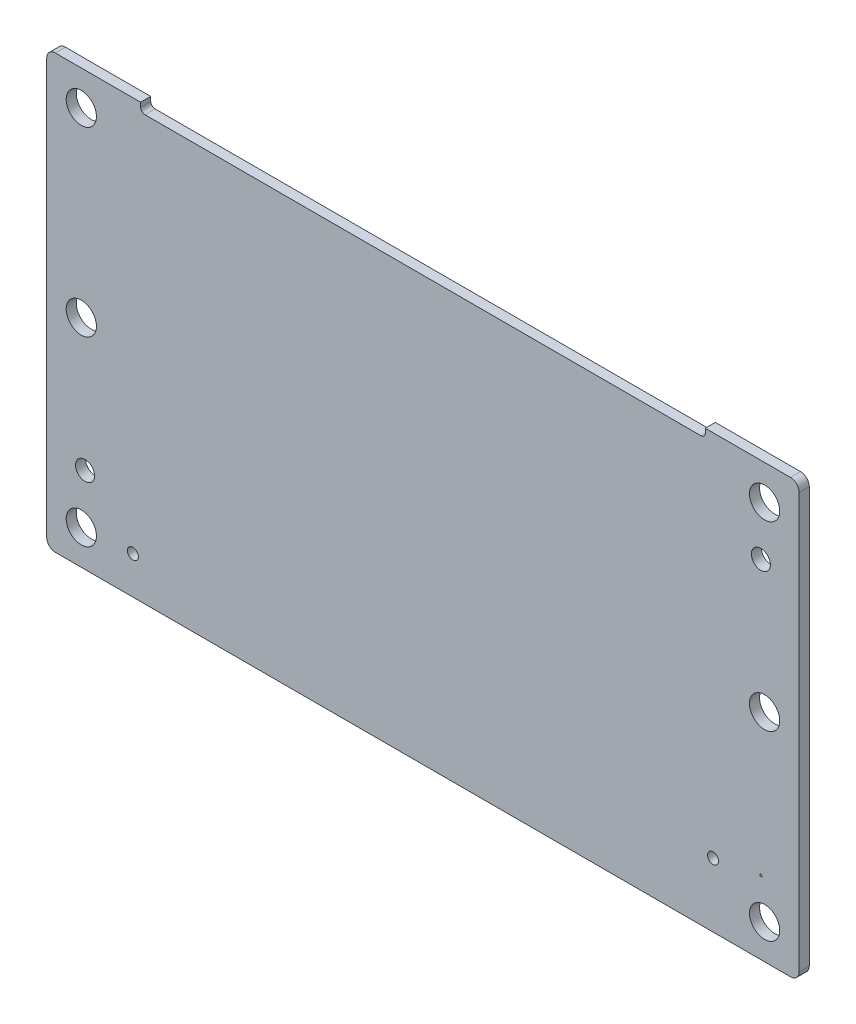
ISO-10303-21;
HEADER;
FILE_DESCRIPTION(('STEP AP214'),'2;1');
FILE_NAME('part.step','',(''),(''),'','','');
FILE_SCHEMA(('AUTOMOTIVE_DESIGN { 1 0 10303 214 1 1 1 1 }'));
ENDSEC;
DATA;
#1=APPLICATION_CONTEXT('core data for automotive mechanical design processes');
#2=APPLICATION_PROTOCOL_DEFINITION('international standard','automotive_design',2000,#1);
#3=PRODUCT_CONTEXT('',#1,'mechanical');
#4=PRODUCT('Part','Part','',(#3));
#5=PRODUCT_RELATED_PRODUCT_CATEGORY('part','',(#4));
#6=PRODUCT_DEFINITION_FORMATION('','',#4);
#7=PRODUCT_DEFINITION_CONTEXT('part definition',#1,'design');
#8=PRODUCT_DEFINITION('design','',#6,#7);
#9=PRODUCT_DEFINITION_SHAPE('','',#8);
#10=(LENGTH_UNIT() NAMED_UNIT(*) SI_UNIT(.MILLI.,.METRE.));
#11=(NAMED_UNIT(*) PLANE_ANGLE_UNIT() SI_UNIT($,.RADIAN.));
#12=(NAMED_UNIT(*) SI_UNIT($,.STERADIAN.) SOLID_ANGLE_UNIT());
#13=UNCERTAINTY_MEASURE_WITH_UNIT(LENGTH_MEASURE(1.E-05),#10,'distance_accuracy_value','');
#14=(GEOMETRIC_REPRESENTATION_CONTEXT(3) GLOBAL_UNCERTAINTY_ASSIGNED_CONTEXT((#13)) GLOBAL_UNIT_ASSIGNED_CONTEXT((#10,
#11,#12)) REPRESENTATION_CONTEXT('',''));
#15=CARTESIAN_POINT('',(0.,0.,0.));
#16=DIRECTION('',(0.,0.,1.));
#17=DIRECTION('',(1.,0.,0.));
#18=AXIS2_PLACEMENT_3D('',#15,#16,#17);
#19=CARTESIAN_POINT('',(0.,0.,1.16399999999992));
#20=DIRECTION('',(0.,0.,1.));
#21=DIRECTION('',(1.,0.,0.));
#22=AXIS2_PLACEMENT_3D('',#19,#20,#21);
#23=PLANE('',#22);
#24=CARTESIAN_POINT('',(0.4319999996,5.9180000004,1.16399999999992));
#25=DIRECTION('',(0.,0.,1.));
#26=DIRECTION('',(1.,0.,0.));
#27=AXIS2_PLACEMENT_3D('',#24,#25,#26);
#28=CIRCLE('',#27,1.0999999971);
#29=CARTESIAN_POINT('',(1.5319999967,5.9180000004,1.16399999999992));
#30=VERTEX_POINT('',#29);
#31=EDGE_CURVE('E220',#30,#30,#28,.F.);
#32=ORIENTED_EDGE('',*,*,#31,.T.);
#33=EDGE_LOOP('',(#32));
#34=FACE_BOUND('',#33,.T.);
#35=CARTESIAN_POINT('',(78.5700000098,4.4300000046,1.16399999999992));
#36=DIRECTION('',(0.,0.,1.));
#37=DIRECTION('',(1.,0.,0.));
#38=AXIS2_PLACEMENT_3D('',#35,#36,#37);
#39=CIRCLE('',#38,0.125000004);
#40=CARTESIAN_POINT('',(78.6950000138,4.4300000046,1.16399999999992));
#41=VERTEX_POINT('',#40);
#42=EDGE_CURVE('E223',#41,#41,#39,.F.);
#43=ORIENTED_EDGE('',*,*,#42,.T.);
#44=EDGE_LOOP('',(#43));
#45=FACE_BOUND('',#44,.T.);
#46=CARTESIAN_POINT('',(78.5700000098,36.0800000014,1.16399999999992));
#47=DIRECTION('',(0.,0.,1.));
#48=DIRECTION('',(1.,0.,0.));
#49=AXIS2_PLACEMENT_3D('',#46,#47,#48);
#50=CIRCLE('',#49,1.0999999971);
#51=CARTESIAN_POINT('',(79.6700000069,36.0800000014,1.16399999999992));
#52=VERTEX_POINT('',#51);
#53=EDGE_CURVE('E226',#52,#52,#50,.F.);
#54=ORIENTED_EDGE('',*,*,#53,.T.);
#55=EDGE_LOOP('',(#54));
#56=FACE_BOUND('',#55,.T.);
#57=CARTESIAN_POINT('',(78.999999988,41.9999999978,1.16399999999992));
#58=DIRECTION('',(0.,0.,1.));
#59=DIRECTION('',(1.,0.,0.));
#60=AXIS2_PLACEMENT_3D('',#57,#58,#59);
#61=CIRCLE('',#60,1.7500000052);
#62=CARTESIAN_POINT('',(80.7499999932,41.9999999978,1.16399999999992));
#63=VERTEX_POINT('',#62);
#64=EDGE_CURVE('E229',#63,#63,#61,.F.);
#65=ORIENTED_EDGE('',*,*,#64,.T.);
#66=EDGE_LOOP('',(#65));
#67=FACE_BOUND('',#66,.T.);
#68=CARTESIAN_POINT('',(78.999999988,21.0000000116,1.16399999999992));
#69=DIRECTION('',(0.,0.,1.));
#70=DIRECTION('',(1.,0.,0.));
#71=AXIS2_PLACEMENT_3D('',#68,#69,#70);
#72=CIRCLE('',#71,1.7500000052);
#73=CARTESIAN_POINT('',(80.7499999932,21.0000000116,1.16399999999992));
#74=VERTEX_POINT('',#73);
#75=EDGE_CURVE('E232',#74,#74,#72,.F.);
#76=ORIENTED_EDGE('',*,*,#75,.T.);
#77=EDGE_LOOP('',(#76));
#78=FACE_BOUND('',#77,.T.);
#79=CARTESIAN_POINT('',(78.999999988,0.,1.16399999999992));
#80=DIRECTION('',(0.,0.,1.));
#81=DIRECTION('',(1.,0.,0.));
#82=AXIS2_PLACEMENT_3D('',#79,#80,#81);
#83=CIRCLE('',#82,1.7500000052);
#84=CARTESIAN_POINT('',(80.7499999932,0.,1.16399999999992));
#85=VERTEX_POINT('',#84);
#86=EDGE_CURVE('E235',#85,#85,#83,.F.);
#87=ORIENTED_EDGE('',*,*,#86,.T.);
#88=EDGE_LOOP('',(#87));
#89=FACE_BOUND('',#88,.T.);
#90=CARTESIAN_POINT('',(0.,41.9999999978,1.16399999999992));
#91=DIRECTION('',(0.,0.,1.));
#92=DIRECTION('',(1.,0.,0.));
#93=AXIS2_PLACEMENT_3D('',#90,#91,#92);
#94=CIRCLE('',#93,1.7500000052);
#95=CARTESIAN_POINT('',(1.7500000052,41.9999999978,1.16399999999992));
#96=VERTEX_POINT('',#95);
#97=EDGE_CURVE('E238',#96,#96,#94,.F.);
#98=ORIENTED_EDGE('',*,*,#97,.T.);
#99=EDGE_LOOP('',(#98));
#100=FACE_BOUND('',#99,.T.);
#101=CARTESIAN_POINT('',(0.,21.0000000116,1.16399999999992));
#102=DIRECTION('',(0.,0.,1.));
#103=DIRECTION('',(1.,0.,0.));
#104=AXIS2_PLACEMENT_3D('',#101,#102,#103);
#105=CIRCLE('',#104,1.7500000052);
#106=CARTESIAN_POINT('',(1.7500000052,21.0000000116,1.16399999999992));
#107=VERTEX_POINT('',#106);
#108=EDGE_CURVE('E241',#107,#107,#105,.F.);
#109=ORIENTED_EDGE('',*,*,#108,.T.);
#110=EDGE_LOOP('',(#109));
#111=FACE_BOUND('',#110,.T.);
#112=CARTESIAN_POINT('',(0.,0.,1.16399999999992));
#113=DIRECTION('',(0.,0.,1.));
#114=DIRECTION('',(1.,0.,0.));
#115=AXIS2_PLACEMENT_3D('',#112,#113,#114);
#116=CIRCLE('',#115,1.7500000052);
#117=CARTESIAN_POINT('',(1.7500000052,0.,1.16399999999992));
#118=VERTEX_POINT('',#117);
#119=EDGE_CURVE('E244',#118,#118,#116,.F.);
#120=ORIENTED_EDGE('',*,*,#119,.T.);
#121=EDGE_LOOP('',(#120));
#122=FACE_BOUND('',#121,.T.);
#123=CARTESIAN_POINT('',(5.9599999926,0.3500000112,1.16399999999992));
#124=DIRECTION('',(0.,0.,1.));
#125=DIRECTION('',(1.,0.,0.));
#126=AXIS2_PLACEMENT_3D('',#123,#124,#125);
#127=CIRCLE('',#126,0.635);
#128=CARTESIAN_POINT('',(6.5949999926,0.3500000112,1.16399999999992));
#129=VERTEX_POINT('',#128);
#130=EDGE_CURVE('E247',#129,#129,#127,.F.);
#131=ORIENTED_EDGE('',*,*,#130,.T.);
#132=EDGE_LOOP('',(#131));
#133=FACE_BOUND('',#132,.T.);
#134=CARTESIAN_POINT('',(73.0399999954,3.4000000072,1.16399999999992));
#135=DIRECTION('',(0.,0.,1.));
#136=DIRECTION('',(1.,0.,0.));
#137=AXIS2_PLACEMENT_3D('',#134,#135,#136);
#138=CIRCLE('',#137,0.635);
#139=CARTESIAN_POINT('',(73.6749999954,3.4000000072,1.16399999999992));
#140=VERTEX_POINT('',#139);
#141=EDGE_CURVE('E250',#140,#140,#138,.F.);
#142=ORIENTED_EDGE('',*,*,#141,.T.);
#143=EDGE_LOOP('',(#142));
#144=FACE_BOUND('',#143,.T.);
#145=DIRECTION('',(0.,1.,0.));
#146=VECTOR('',#145,1.);
#147=CARTESIAN_POINT('',(6.8600000000005,45.4999999999958,1.16399999999992));
#148=LINE('',#147,#146);
#149=CARTESIAN_POINT('',(6.8600000000005,45.9999999999938,1.16399999999992));
#150=VERTEX_POINT('',#149);
#151=CARTESIAN_POINT('',(6.8600000000005,45.4999999999958,1.16399999999992));
#152=VERTEX_POINT('',#151);
#153=EDGE_CURVE('E123',#150,#152,#148,.F.);
#154=ORIENTED_EDGE('',*,*,#153,.F.);
#155=DIRECTION('',(1.,0.,0.));
#156=VECTOR('',#155,1.);
#157=CARTESIAN_POINT('',(6.8600000000005,45.9999999999938,1.16399999999992));
#158=LINE('',#157,#156);
#159=CARTESIAN_POINT('',(-3.0000000000007,45.9999999999958,1.16399999999992));
#160=VERTEX_POINT('',#159);
#161=EDGE_CURVE('E119',#160,#150,#158,.T.);
#162=ORIENTED_EDGE('',*,*,#161,.F.);
#163=CARTESIAN_POINT('',(-3.0000000000007,44.9999999999978,1.16399999999992));
#164=DIRECTION('',(0.,0.,1.));
#165=DIRECTION('',(1.,0.,0.));
#166=AXIS2_PLACEMENT_3D('',#163,#164,#165);
#167=CIRCLE('',#166,1.00000000000006);
#168=CARTESIAN_POINT('',(-3.99999999999924,44.9999999999978,1.16399999999992));
#169=VERTEX_POINT('',#168);
#170=EDGE_CURVE('E18',#169,#160,#167,.F.);
#171=ORIENTED_EDGE('',*,*,#170,.F.);
#172=DIRECTION('',(0.,1.,0.));
#173=VECTOR('',#172,1.);
#174=CARTESIAN_POINT('',(-3.99999999999924,44.9999999999978,1.16399999999992));
#175=LINE('',#174,#173);
#176=CARTESIAN_POINT('',(-4.,-3.0000000000007,1.16399999999992));
#177=VERTEX_POINT('',#176);
#178=EDGE_CURVE('E106',#177,#169,#175,.T.);
#179=ORIENTED_EDGE('',*,*,#178,.F.);
#180=CARTESIAN_POINT('',(-3.0000000000007,-3.0000000000007,1.16399999999992));
#181=DIRECTION('',(0.,0.,1.));
#182=DIRECTION('',(1.,0.,0.));
#183=AXIS2_PLACEMENT_3D('',#180,#181,#182);
#184=CIRCLE('',#183,1.00000000000006);
#185=CARTESIAN_POINT('',(-3.0000000000007,-3.99999999999924,1.16399999999992));
#186=VERTEX_POINT('',#185);
#187=EDGE_CURVE('E262',#186,#177,#184,.F.);
#188=ORIENTED_EDGE('',*,*,#187,.F.);
#189=DIRECTION('',(1.,0.,0.));
#190=VECTOR('',#189,1.);
#191=CARTESIAN_POINT('',(-3.0000000000007,-3.99999999999924,1.16399999999992));
#192=LINE('',#191,#190);
#193=CARTESIAN_POINT('',(82.0000000000022,-4.,1.16399999999992));
#194=VERTEX_POINT('',#193);
#195=EDGE_CURVE('E163',#194,#186,#192,.F.);
#196=ORIENTED_EDGE('',*,*,#195,.F.);
#197=CARTESIAN_POINT('',(82.0000000000022,-3.0000000000007,1.16399999999992));
#198=DIRECTION('',(0.,0.,1.));
#199=DIRECTION('',(1.,0.,0.));
#200=AXIS2_PLACEMENT_3D('',#197,#198,#199);
#201=CIRCLE('',#200,1.00000000000006);
#202=CARTESIAN_POINT('',(82.9999999999982,-3.0000000000007,1.16399999999992));
#203=VERTEX_POINT('',#202);
#204=EDGE_CURVE('E261',#203,#194,#201,.F.);
#205=ORIENTED_EDGE('',*,*,#204,.F.);
#206=DIRECTION('',(0.,1.,0.));
#207=VECTOR('',#206,1.);
#208=CARTESIAN_POINT('',(82.9999999999982,-3.0000000000007,1.16399999999992));
#209=LINE('',#208,#207);
#210=CARTESIAN_POINT('',(83.0000000000002,44.9999999999978,1.16399999999992));
#211=VERTEX_POINT('',#210);
#212=EDGE_CURVE('E159',#211,#203,#209,.F.);
#213=ORIENTED_EDGE('',*,*,#212,.F.);
#214=CARTESIAN_POINT('',(82.0000000000022,44.9999999999978,1.16399999999992));
#215=DIRECTION('',(0.,0.,1.));
#216=DIRECTION('',(1.,0.,0.));
#217=AXIS2_PLACEMENT_3D('',#214,#215,#216);
#218=CIRCLE('',#217,1.00000000000006);
#219=CARTESIAN_POINT('',(82.0000000000022,45.9999999999938,1.16399999999992));
#220=VERTEX_POINT('',#219);
#221=EDGE_CURVE('E259',#220,#211,#218,.F.);
#222=ORIENTED_EDGE('',*,*,#221,.F.);
#223=DIRECTION('',(1.,0.,0.));
#224=VECTOR('',#223,1.);
#225=CARTESIAN_POINT('',(82.0000000000022,45.9999999999938,1.16399999999992));
#226=LINE('',#225,#224);
#227=CARTESIAN_POINT('',(72.140000000001,45.9999999999938,1.16399999999992));
#228=VERTEX_POINT('',#227);
#229=EDGE_CURVE('E154',#228,#220,#226,.T.);
#230=ORIENTED_EDGE('',*,*,#229,.F.);
#231=DIRECTION('',(0.,1.,0.));
#232=VECTOR('',#231,1.);
#233=CARTESIAN_POINT('',(72.140000000001,45.9999999999938,1.16399999999992));
#234=LINE('',#233,#232);
#235=CARTESIAN_POINT('',(72.140000000002,45.4999999999958,1.16399999999992));
#236=VERTEX_POINT('',#235);
#237=EDGE_CURVE('E147',#236,#228,#234,.T.);
#238=ORIENTED_EDGE('',*,*,#237,.F.);
#239=CARTESIAN_POINT('',(71.640000000003,45.4999999999958,1.16399999999992));
#240=DIRECTION('',(0.,0.,1.));
#241=DIRECTION('',(1.,0.,0.));
#242=AXIS2_PLACEMENT_3D('',#239,#240,#241);
#243=CIRCLE('',#242,0.500000000000032);
#244=CARTESIAN_POINT('',(71.640000000003,44.9999999999978,1.16399999999992));
#245=VERTEX_POINT('',#244);
#246=EDGE_CURVE('E146',#236,#245,#243,.F.);
#247=ORIENTED_EDGE('',*,*,#246,.T.);
#248=DIRECTION('',(1.,0.,0.));
#249=VECTOR('',#248,1.);
#250=CARTESIAN_POINT('',(71.640000000003,44.9999999999978,1.16399999999992));
#251=LINE('',#250,#249);
#252=CARTESIAN_POINT('',(7.36000000000104,44.9999999999968,1.16399999999992));
#253=VERTEX_POINT('',#252);
#254=EDGE_CURVE('E143',#253,#245,#251,.T.);
#255=ORIENTED_EDGE('',*,*,#254,.F.);
#256=CARTESIAN_POINT('',(7.36000000000104,45.4999999999958,1.16399999999992));
#257=DIRECTION('',(0.,0.,1.));
#258=DIRECTION('',(1.,0.,0.));
#259=AXIS2_PLACEMENT_3D('',#256,#257,#258);
#260=CIRCLE('',#259,0.500000000000032);
#261=EDGE_CURVE('E253',#253,#152,#260,.F.);
#262=ORIENTED_EDGE('',*,*,#261,.T.);
#263=EDGE_LOOP('',(#154,#162,#171,#179,#188,#196,#205,#213,#222,#230,#238,#247,#255,#262));
#264=FACE_BOUND('',#263,.T.);
#265=ADVANCED_FACE('F15',(#34,#45,#56,#67,#78,#89,#100,#111,#122,#133,#144,#264),#23,.T.);
#266=CARTESIAN_POINT('',(6.8600000000005,45.9999999999938,0.));
#267=DIRECTION('',(0.,1.,0.));
#268=DIRECTION('',(0.,0.,1.));
#269=AXIS2_PLACEMENT_3D('',#266,#267,#268);
#270=PLANE('',#269);
#271=DIRECTION('',(0.,0.,-1.));
#272=VECTOR('',#271,1.);
#273=CARTESIAN_POINT('',(6.8600000000005,45.9999999999938,0.));
#274=LINE('',#273,#272);
#275=CARTESIAN_POINT('',(6.8600000000005,45.9999999999938,0.));
#276=VERTEX_POINT('',#275);
#277=EDGE_CURVE('E138',#276,#150,#274,.F.);
#278=ORIENTED_EDGE('',*,*,#277,.F.);
#279=DIRECTION('',(1.,0.,0.));
#280=VECTOR('',#279,1.);
#281=CARTESIAN_POINT('',(0.,45.9999999999938,0.));
#282=LINE('',#281,#280);
#283=CARTESIAN_POINT('',(-3.0000000000007,45.9999999999958,0.));
#284=VERTEX_POINT('',#283);
#285=EDGE_CURVE('E131',#276,#284,#282,.F.);
#286=ORIENTED_EDGE('',*,*,#285,.T.);
#287=DIRECTION('',(0.,0.,1.));
#288=VECTOR('',#287,1.);
#289=CARTESIAN_POINT('',(-3.0000000000007,45.9999999999979,0.));
#290=LINE('',#289,#288);
#291=EDGE_CURVE('E115',#160,#284,#290,.F.);
#292=ORIENTED_EDGE('',*,*,#291,.F.);
#293=ORIENTED_EDGE('',*,*,#161,.T.);
#294=EDGE_LOOP('',(#278,#286,#292,#293));
#295=FACE_BOUND('',#294,.T.);
#296=ADVANCED_FACE('F129',(#295),#270,.T.);
#297=CARTESIAN_POINT('',(-3.0000000000007,44.9999999999978,0.));
#298=DIRECTION('',(0.,0.,1.));
#299=DIRECTION('',(1.,0.,0.));
#300=AXIS2_PLACEMENT_3D('',#297,#298,#299);
#301=CYLINDRICAL_SURFACE('',#300,1.00000000000006);
#302=ORIENTED_EDGE('',*,*,#291,.T.);
#303=CARTESIAN_POINT('',(-3.0000000000007,44.9999999999978,0.));
#304=DIRECTION('',(0.,0.,1.));
#305=DIRECTION('',(1.,0.,0.));
#306=AXIS2_PLACEMENT_3D('',#303,#304,#305);
#307=CIRCLE('',#306,1.00000000000006);
#308=CARTESIAN_POINT('',(-3.99999999999924,44.9999999999978,0.));
#309=VERTEX_POINT('',#308);
#310=EDGE_CURVE('E218',#284,#309,#307,.T.);
#311=ORIENTED_EDGE('',*,*,#310,.T.);
#312=DIRECTION('',(0.,0.,1.));
#313=VECTOR('',#312,1.);
#314=CARTESIAN_POINT('',(-3.99999999999924,44.9999999999978,0.));
#315=LINE('',#314,#313);
#316=EDGE_CURVE('E117',#169,#309,#315,.F.);
#317=ORIENTED_EDGE('',*,*,#316,.F.);
#318=ORIENTED_EDGE('',*,*,#170,.T.);
#319=EDGE_LOOP('',(#302,#311,#317,#318));
#320=FACE_BOUND('',#319,.T.);
#321=ADVANCED_FACE('F112',(#320),#301,.T.);
#322=CARTESIAN_POINT('',(-3.99999999999924,44.9999999999978,0.));
#323=DIRECTION('',(-1.,0.,0.));
#324=DIRECTION('',(0.,0.,1.));
#325=AXIS2_PLACEMENT_3D('',#322,#323,#324);
#326=PLANE('',#325);
#327=ORIENTED_EDGE('',*,*,#316,.T.);
#328=DIRECTION('',(0.,1.,0.));
#329=VECTOR('',#328,1.);
#330=CARTESIAN_POINT('',(-3.99999999999924,0.,0.));
#331=LINE('',#330,#329);
#332=CARTESIAN_POINT('',(-4.,-3.0000000000007,0.));
#333=VERTEX_POINT('',#332);
#334=EDGE_CURVE('E217',#309,#333,#331,.F.);
#335=ORIENTED_EDGE('',*,*,#334,.T.);
#336=DIRECTION('',(0.,0.,1.));
#337=VECTOR('',#336,1.);
#338=CARTESIAN_POINT('',(-4.00000000000076,-3.0000000000007,0.));
#339=LINE('',#338,#337);
#340=EDGE_CURVE('E165',#177,#333,#339,.F.);
#341=ORIENTED_EDGE('',*,*,#340,.F.);
#342=ORIENTED_EDGE('',*,*,#178,.T.);
#343=EDGE_LOOP('',(#327,#335,#341,#342));
#344=FACE_BOUND('',#343,.T.);
#345=ADVANCED_FACE('F268',(#344),#326,.T.);
#346=CARTESIAN_POINT('',(-3.0000000000007,-3.0000000000007,0.));
#347=DIRECTION('',(0.,0.,1.));
#348=DIRECTION('',(1.,0.,0.));
#349=AXIS2_PLACEMENT_3D('',#346,#347,#348);
#350=CYLINDRICAL_SURFACE('',#349,1.00000000000006);
#351=ORIENTED_EDGE('',*,*,#340,.T.);
#352=CARTESIAN_POINT('',(-3.0000000000007,-3.0000000000007,0.));
#353=DIRECTION('',(0.,0.,1.));
#354=DIRECTION('',(1.,0.,0.));
#355=AXIS2_PLACEMENT_3D('',#352,#353,#354);
#356=CIRCLE('',#355,1.00000000000006);
#357=CARTESIAN_POINT('',(-3.0000000000007,-3.99999999999924,0.));
#358=VERTEX_POINT('',#357);
#359=EDGE_CURVE('E214',#333,#358,#356,.T.);
#360=ORIENTED_EDGE('',*,*,#359,.T.);
#361=DIRECTION('',(0.,0.,-1.));
#362=VECTOR('',#361,1.);
#363=CARTESIAN_POINT('',(-3.0000000000007,-3.99999999999924,0.));
#364=LINE('',#363,#362);
#365=EDGE_CURVE('E164',#186,#358,#364,.T.);
#366=ORIENTED_EDGE('',*,*,#365,.F.);
#367=ORIENTED_EDGE('',*,*,#187,.T.);
#368=EDGE_LOOP('',(#351,#360,#366,#367));
#369=FACE_BOUND('',#368,.T.);
#370=ADVANCED_FACE('F305',(#369),#350,.T.);
#371=CARTESIAN_POINT('',(-3.0000000000007,-3.99999999999924,0.));
#372=DIRECTION('',(0.,-1.,0.));
#373=DIRECTION('',(0.,0.,-1.));
#374=AXIS2_PLACEMENT_3D('',#371,#372,#373);
#375=PLANE('',#374);
#376=ORIENTED_EDGE('',*,*,#365,.T.);
#377=DIRECTION('',(1.,0.,0.));
#378=VECTOR('',#377,1.);
#379=CARTESIAN_POINT('',(0.,-3.99999999999924,0.));
#380=LINE('',#379,#378);
#381=CARTESIAN_POINT('',(82.0000000000022,-4.,0.));
#382=VERTEX_POINT('',#381);
#383=EDGE_CURVE('E213',#358,#382,#380,.T.);
#384=ORIENTED_EDGE('',*,*,#383,.T.);
#385=DIRECTION('',(0.,0.,1.));
#386=VECTOR('',#385,1.);
#387=CARTESIAN_POINT('',(82.0000000000022,-4.00000000000076,0.));
#388=LINE('',#387,#386);
#389=EDGE_CURVE('E162',#194,#382,#388,.F.);
#390=ORIENTED_EDGE('',*,*,#389,.F.);
#391=ORIENTED_EDGE('',*,*,#195,.T.);
#392=EDGE_LOOP('',(#376,#384,#390,#391));
#393=FACE_BOUND('',#392,.T.);
#394=ADVANCED_FACE('F300',(#393),#375,.T.);
#395=CARTESIAN_POINT('',(82.0000000000022,-3.0000000000007,0.));
#396=DIRECTION('',(0.,0.,1.));
#397=DIRECTION('',(1.,0.,0.));
#398=AXIS2_PLACEMENT_3D('',#395,#396,#397);
#399=CYLINDRICAL_SURFACE('',#398,1.00000000000006);
#400=ORIENTED_EDGE('',*,*,#389,.T.);
#401=CARTESIAN_POINT('',(82.0000000000022,-3.0000000000007,0.));
#402=DIRECTION('',(0.,0.,1.));
#403=DIRECTION('',(1.,0.,0.));
#404=AXIS2_PLACEMENT_3D('',#401,#402,#403);
#405=CIRCLE('',#404,1.00000000000006);
#406=CARTESIAN_POINT('',(82.9999999999982,-3.0000000000007,0.));
#407=VERTEX_POINT('',#406);
#408=EDGE_CURVE('E210',#382,#407,#405,.T.);
#409=ORIENTED_EDGE('',*,*,#408,.T.);
#410=DIRECTION('',(0.,0.,-1.));
#411=VECTOR('',#410,1.);
#412=CARTESIAN_POINT('',(82.9999999999982,-3.0000000000007,0.));
#413=LINE('',#412,#411);
#414=EDGE_CURVE('E161',#203,#407,#413,.T.);
#415=ORIENTED_EDGE('',*,*,#414,.F.);
#416=ORIENTED_EDGE('',*,*,#204,.T.);
#417=EDGE_LOOP('',(#400,#409,#415,#416));
#418=FACE_BOUND('',#417,.T.);
#419=ADVANCED_FACE('F313',(#418),#399,.T.);
#420=CARTESIAN_POINT('',(82.9999999999982,-3.0000000000007,0.));
#421=DIRECTION('',(1.,0.,0.));
#422=DIRECTION('',(0.,0.,-1.));
#423=AXIS2_PLACEMENT_3D('',#420,#421,#422);
#424=PLANE('',#423);
#425=ORIENTED_EDGE('',*,*,#414,.T.);
#426=DIRECTION('',(0.,1.,0.));
#427=VECTOR('',#426,1.);
#428=CARTESIAN_POINT('',(82.9999999999982,0.,0.));
#429=LINE('',#428,#427);
#430=CARTESIAN_POINT('',(83.0000000000002,44.9999999999978,0.));
#431=VERTEX_POINT('',#430);
#432=EDGE_CURVE('E209',#407,#431,#429,.T.);
#433=ORIENTED_EDGE('',*,*,#432,.T.);
#434=DIRECTION('',(0.,0.,1.));
#435=VECTOR('',#434,1.);
#436=CARTESIAN_POINT('',(83.0000000000023,44.9999999999978,0.));
#437=LINE('',#436,#435);
#438=EDGE_CURVE('E156',#211,#431,#437,.F.);
#439=ORIENTED_EDGE('',*,*,#438,.F.);
#440=ORIENTED_EDGE('',*,*,#212,.T.);
#441=EDGE_LOOP('',(#425,#433,#439,#440));
#442=FACE_BOUND('',#441,.T.);
#443=ADVANCED_FACE('F394',(#442),#424,.T.);
#444=CARTESIAN_POINT('',(82.0000000000022,44.9999999999978,0.));
#445=DIRECTION('',(0.,0.,1.));
#446=DIRECTION('',(1.,0.,0.));
#447=AXIS2_PLACEMENT_3D('',#444,#445,#446);
#448=CYLINDRICAL_SURFACE('',#447,1.00000000000006);
#449=ORIENTED_EDGE('',*,*,#438,.T.);
#450=CARTESIAN_POINT('',(82.0000000000022,44.9999999999978,0.));
#451=DIRECTION('',(0.,0.,1.));
#452=DIRECTION('',(1.,0.,0.));
#453=AXIS2_PLACEMENT_3D('',#450,#451,#452);
#454=CIRCLE('',#453,1.00000000000006);
#455=CARTESIAN_POINT('',(82.0000000000022,45.9999999999938,0.));
#456=VERTEX_POINT('',#455);
#457=EDGE_CURVE('E205',#431,#456,#454,.T.);
#458=ORIENTED_EDGE('',*,*,#457,.T.);
#459=DIRECTION('',(0.,0.,1.));
#460=VECTOR('',#459,1.);
#461=CARTESIAN_POINT('',(82.0000000000022,45.9999999999938,0.));
#462=LINE('',#461,#460);
#463=EDGE_CURVE('E151',#220,#456,#462,.F.);
#464=ORIENTED_EDGE('',*,*,#463,.F.);
#465=ORIENTED_EDGE('',*,*,#221,.T.);
#466=EDGE_LOOP('',(#449,#458,#464,#465));
#467=FACE_BOUND('',#466,.T.);
#468=ADVANCED_FACE('F390',(#467),#448,.T.);
#469=CARTESIAN_POINT('',(82.0000000000022,45.9999999999938,0.));
#470=DIRECTION('',(0.,1.,0.));
#471=DIRECTION('',(0.,0.,1.));
#472=AXIS2_PLACEMENT_3D('',#469,#470,#471);
#473=PLANE('',#472);
#474=ORIENTED_EDGE('',*,*,#463,.T.);
#475=DIRECTION('',(1.,0.,0.));
#476=VECTOR('',#475,1.);
#477=CARTESIAN_POINT('',(0.,45.9999999999938,0.));
#478=LINE('',#477,#476);
#479=CARTESIAN_POINT('',(72.140000000001,45.9999999999938,0.));
#480=VERTEX_POINT('',#479);
#481=EDGE_CURVE('E208',#456,#480,#478,.F.);
#482=ORIENTED_EDGE('',*,*,#481,.T.);
#483=DIRECTION('',(0.,0.,1.));
#484=VECTOR('',#483,1.);
#485=CARTESIAN_POINT('',(72.140000000001,45.9999999999938,0.));
#486=LINE('',#485,#484);
#487=EDGE_CURVE('E150',#228,#480,#486,.F.);
#488=ORIENTED_EDGE('',*,*,#487,.F.);
#489=ORIENTED_EDGE('',*,*,#229,.T.);
#490=EDGE_LOOP('',(#474,#482,#488,#489));
#491=FACE_BOUND('',#490,.T.);
#492=ADVANCED_FACE('F386',(#491),#473,.T.);
#493=CARTESIAN_POINT('',(72.140000000001,45.9999999999938,0.));
#494=DIRECTION('',(-1.,0.,0.));
#495=DIRECTION('',(0.,0.,1.));
#496=AXIS2_PLACEMENT_3D('',#493,#494,#495);
#497=PLANE('',#496);
#498=ORIENTED_EDGE('',*,*,#487,.T.);
#499=DIRECTION('',(0.,1.,0.));
#500=VECTOR('',#499,1.);
#501=CARTESIAN_POINT('',(72.140000000001,0.,0.));
#502=LINE('',#501,#500);
#503=CARTESIAN_POINT('',(72.140000000002,45.4999999999958,0.));
#504=VERTEX_POINT('',#503);
#505=EDGE_CURVE('E204',#480,#504,#502,.F.);
#506=ORIENTED_EDGE('',*,*,#505,.T.);
#507=DIRECTION('',(0.,0.,1.));
#508=VECTOR('',#507,1.);
#509=CARTESIAN_POINT('',(72.140000000003,45.4999999999958,0.));
#510=LINE('',#509,#508);
#511=EDGE_CURVE('E258',#504,#236,#510,.T.);
#512=ORIENTED_EDGE('',*,*,#511,.T.);
#513=ORIENTED_EDGE('',*,*,#237,.T.);
#514=EDGE_LOOP('',(#498,#506,#512,#513));
#515=FACE_BOUND('',#514,.T.);
#516=ADVANCED_FACE('F382',(#515),#497,.T.);
#517=CARTESIAN_POINT('',(71.640000000003,45.4999999999958,0.));
#518=DIRECTION('',(0.,0.,1.));
#519=DIRECTION('',(1.,0.,0.));
#520=AXIS2_PLACEMENT_3D('',#517,#518,#519);
#521=CYLINDRICAL_SURFACE('',#520,0.500000000000032);
#522=ORIENTED_EDGE('',*,*,#246,.F.);
#523=ORIENTED_EDGE('',*,*,#511,.F.);
#524=CARTESIAN_POINT('',(71.640000000003,45.4999999999958,0.));
#525=DIRECTION('',(0.,0.,1.));
#526=DIRECTION('',(1.,0.,0.));
#527=AXIS2_PLACEMENT_3D('',#524,#525,#526);
#528=CIRCLE('',#527,0.500000000000032);
#529=CARTESIAN_POINT('',(71.640000000003,44.9999999999978,0.));
#530=VERTEX_POINT('',#529);
#531=EDGE_CURVE('E201',#504,#530,#528,.F.);
#532=ORIENTED_EDGE('',*,*,#531,.T.);
#533=DIRECTION('',(0.,0.,1.));
#534=VECTOR('',#533,1.);
#535=CARTESIAN_POINT('',(71.640000000003,44.9999999999978,0.));
#536=LINE('',#535,#534);
#537=EDGE_CURVE('E145',#245,#530,#536,.F.);
#538=ORIENTED_EDGE('',*,*,#537,.F.);
#539=EDGE_LOOP('',(#522,#523,#532,#538));
#540=FACE_BOUND('',#539,.T.);
#541=ADVANCED_FACE('F378',(#540),#521,.F.);
#542=CARTESIAN_POINT('',(71.640000000003,44.9999999999978,0.));
#543=DIRECTION('',(0.,1.,0.));
#544=DIRECTION('',(0.,0.,1.));
#545=AXIS2_PLACEMENT_3D('',#542,#543,#544);
#546=PLANE('',#545);
#547=ORIENTED_EDGE('',*,*,#537,.T.);
#548=DIRECTION('',(1.,0.,0.));
#549=VECTOR('',#548,1.);
#550=CARTESIAN_POINT('',(0.,44.9999999999978,0.));
#551=LINE('',#550,#549);
#552=CARTESIAN_POINT('',(7.36000000000104,44.9999999999968,0.));
#553=VERTEX_POINT('',#552);
#554=EDGE_CURVE('E200',#530,#553,#551,.F.);
#555=ORIENTED_EDGE('',*,*,#554,.T.);
#556=DIRECTION('',(0.,0.,1.));
#557=VECTOR('',#556,1.);
#558=CARTESIAN_POINT('',(7.36000000000104,44.9999999999958,0.));
#559=LINE('',#558,#557);
#560=EDGE_CURVE('E255',#553,#253,#559,.T.);
#561=ORIENTED_EDGE('',*,*,#560,.T.);
#562=ORIENTED_EDGE('',*,*,#254,.T.);
#563=EDGE_LOOP('',(#547,#555,#561,#562));
#564=FACE_BOUND('',#563,.T.);
#565=ADVANCED_FACE('F374',(#564),#546,.T.);
#566=CARTESIAN_POINT('',(7.36000000000104,45.4999999999958,0.));
#567=DIRECTION('',(0.,0.,1.));
#568=DIRECTION('',(1.,0.,0.));
#569=AXIS2_PLACEMENT_3D('',#566,#567,#568);
#570=CYLINDRICAL_SURFACE('',#569,0.500000000000032);
#571=ORIENTED_EDGE('',*,*,#261,.F.);
#572=ORIENTED_EDGE('',*,*,#560,.F.);
#573=CARTESIAN_POINT('',(7.36000000000104,45.4999999999958,0.));
#574=DIRECTION('',(0.,0.,1.));
#575=DIRECTION('',(1.,0.,0.));
#576=AXIS2_PLACEMENT_3D('',#573,#574,#575);
#577=CIRCLE('',#576,0.500000000000032);
#578=CARTESIAN_POINT('',(6.8600000000005,45.4999999999958,0.));
#579=VERTEX_POINT('',#578);
#580=EDGE_CURVE('E197',#553,#579,#577,.F.);
#581=ORIENTED_EDGE('',*,*,#580,.T.);
#582=DIRECTION('',(0.,0.,-1.));
#583=VECTOR('',#582,1.);
#584=CARTESIAN_POINT('',(6.8600000000005,45.4999999999958,0.));
#585=LINE('',#584,#583);
#586=EDGE_CURVE('E33',#152,#579,#585,.T.);
#587=ORIENTED_EDGE('',*,*,#586,.F.);
#588=EDGE_LOOP('',(#571,#572,#581,#587));
#589=FACE_BOUND('',#588,.T.);
#590=ADVANCED_FACE('F371',(#589),#570,.F.);
#591=CARTESIAN_POINT('',(6.8600000000005,45.4999999999958,0.));
#592=DIRECTION('',(1.,0.,0.));
#593=DIRECTION('',(0.,0.,-1.));
#594=AXIS2_PLACEMENT_3D('',#591,#592,#593);
#595=PLANE('',#594);
#596=ORIENTED_EDGE('',*,*,#586,.T.);
#597=DIRECTION('',(0.,1.,0.));
#598=VECTOR('',#597,1.);
#599=CARTESIAN_POINT('',(6.8600000000005,0.,0.));
#600=LINE('',#599,#598);
#601=EDGE_CURVE('E196',#579,#276,#600,.T.);
#602=ORIENTED_EDGE('',*,*,#601,.T.);
#603=ORIENTED_EDGE('',*,*,#277,.T.);
#604=ORIENTED_EDGE('',*,*,#153,.T.);
#605=EDGE_LOOP('',(#596,#602,#603,#604));
#606=FACE_BOUND('',#605,.T.);
#607=ADVANCED_FACE('F367',(#606),#595,.T.);
#608=CARTESIAN_POINT('',(73.0399999954,3.4000000072,0.));
#609=DIRECTION('',(0.,0.,1.));
#610=DIRECTION('',(1.,0.,0.));
#611=AXIS2_PLACEMENT_3D('',#608,#609,#610);
#612=CYLINDRICAL_SURFACE('',#611,0.635);
#613=ORIENTED_EDGE('',*,*,#141,.F.);
#614=EDGE_LOOP('',(#613));
#615=FACE_BOUND('',#614,.T.);
#616=CARTESIAN_POINT('',(73.0399999954,3.4000000072,0.));
#617=DIRECTION('',(0.,0.,1.));
#618=DIRECTION('',(1.,0.,0.));
#619=AXIS2_PLACEMENT_3D('',#616,#617,#618);
#620=CIRCLE('',#619,0.635);
#621=CARTESIAN_POINT('',(73.6749999954,3.4000000072,0.));
#622=VERTEX_POINT('',#621);
#623=EDGE_CURVE('E193',#622,#622,#620,.F.);
#624=ORIENTED_EDGE('',*,*,#623,.T.);
#625=EDGE_LOOP('',(#624));
#626=FACE_BOUND('',#625,.T.);
#627=ADVANCED_FACE('F363',(#615,#626),#612,.F.);
#628=CARTESIAN_POINT('',(5.9599999926,0.3500000112,0.));
#629=DIRECTION('',(0.,0.,1.));
#630=DIRECTION('',(1.,0.,0.));
#631=AXIS2_PLACEMENT_3D('',#628,#629,#630);
#632=CYLINDRICAL_SURFACE('',#631,0.635);
#633=ORIENTED_EDGE('',*,*,#130,.F.);
#634=EDGE_LOOP('',(#633));
#635=FACE_BOUND('',#634,.T.);
#636=CARTESIAN_POINT('',(5.9599999926,0.3500000112,0.));
#637=DIRECTION('',(0.,0.,1.));
#638=DIRECTION('',(1.,0.,0.));
#639=AXIS2_PLACEMENT_3D('',#636,#637,#638);
#640=CIRCLE('',#639,0.635);
#641=CARTESIAN_POINT('',(6.5949999926,0.3500000112,0.));
#642=VERTEX_POINT('',#641);
#643=EDGE_CURVE('E190',#642,#642,#640,.F.);
#644=ORIENTED_EDGE('',*,*,#643,.T.);
#645=EDGE_LOOP('',(#644));
#646=FACE_BOUND('',#645,.T.);
#647=ADVANCED_FACE('F359',(#635,#646),#632,.F.);
#648=CARTESIAN_POINT('',(0.,0.,0.));
#649=DIRECTION('',(0.,0.,1.));
#650=DIRECTION('',(1.,0.,0.));
#651=AXIS2_PLACEMENT_3D('',#648,#649,#650);
#652=CYLINDRICAL_SURFACE('',#651,1.7500000052);
#653=ORIENTED_EDGE('',*,*,#119,.F.);
#654=EDGE_LOOP('',(#653));
#655=FACE_BOUND('',#654,.T.);
#656=CARTESIAN_POINT('',(0.,0.,0.));
#657=DIRECTION('',(0.,0.,1.));
#658=DIRECTION('',(1.,0.,0.));
#659=AXIS2_PLACEMENT_3D('',#656,#657,#658);
#660=CIRCLE('',#659,1.7500000052);
#661=CARTESIAN_POINT('',(1.7500000052,0.,0.));
#662=VERTEX_POINT('',#661);
#663=EDGE_CURVE('E187',#662,#662,#660,.F.);
#664=ORIENTED_EDGE('',*,*,#663,.T.);
#665=EDGE_LOOP('',(#664));
#666=FACE_BOUND('',#665,.T.);
#667=ADVANCED_FACE('F355',(#655,#666),#652,.F.);
#668=CARTESIAN_POINT('',(0.,21.0000000116,0.));
#669=DIRECTION('',(0.,0.,1.));
#670=DIRECTION('',(1.,0.,0.));
#671=AXIS2_PLACEMENT_3D('',#668,#669,#670);
#672=CYLINDRICAL_SURFACE('',#671,1.7500000052);
#673=ORIENTED_EDGE('',*,*,#108,.F.);
#674=EDGE_LOOP('',(#673));
#675=FACE_BOUND('',#674,.T.);
#676=CARTESIAN_POINT('',(0.,21.0000000116,0.));
#677=DIRECTION('',(0.,0.,1.));
#678=DIRECTION('',(1.,0.,0.));
#679=AXIS2_PLACEMENT_3D('',#676,#677,#678);
#680=CIRCLE('',#679,1.7500000052);
#681=CARTESIAN_POINT('',(1.7500000052,21.0000000116,0.));
#682=VERTEX_POINT('',#681);
#683=EDGE_CURVE('E184',#682,#682,#680,.F.);
#684=ORIENTED_EDGE('',*,*,#683,.T.);
#685=EDGE_LOOP('',(#684));
#686=FACE_BOUND('',#685,.T.);
#687=ADVANCED_FACE('F351',(#675,#686),#672,.F.);
#688=CARTESIAN_POINT('',(0.,41.9999999978,0.));
#689=DIRECTION('',(0.,0.,1.));
#690=DIRECTION('',(1.,0.,0.));
#691=AXIS2_PLACEMENT_3D('',#688,#689,#690);
#692=CYLINDRICAL_SURFACE('',#691,1.7500000052);
#693=ORIENTED_EDGE('',*,*,#97,.F.);
#694=EDGE_LOOP('',(#693));
#695=FACE_BOUND('',#694,.T.);
#696=CARTESIAN_POINT('',(0.,41.9999999978,0.));
#697=DIRECTION('',(0.,0.,1.));
#698=DIRECTION('',(1.,0.,0.));
#699=AXIS2_PLACEMENT_3D('',#696,#697,#698);
#700=CIRCLE('',#699,1.7500000052);
#701=CARTESIAN_POINT('',(1.7500000052,41.9999999978,0.));
#702=VERTEX_POINT('',#701);
#703=EDGE_CURVE('E181',#702,#702,#700,.F.);
#704=ORIENTED_EDGE('',*,*,#703,.T.);
#705=EDGE_LOOP('',(#704));
#706=FACE_BOUND('',#705,.T.);
#707=ADVANCED_FACE('F347',(#695,#706),#692,.F.);
#708=CARTESIAN_POINT('',(78.999999988,0.,0.));
#709=DIRECTION('',(0.,0.,1.));
#710=DIRECTION('',(1.,0.,0.));
#711=AXIS2_PLACEMENT_3D('',#708,#709,#710);
#712=CYLINDRICAL_SURFACE('',#711,1.7500000052);
#713=ORIENTED_EDGE('',*,*,#86,.F.);
#714=EDGE_LOOP('',(#713));
#715=FACE_BOUND('',#714,.T.);
#716=CARTESIAN_POINT('',(78.999999988,0.,0.));
#717=DIRECTION('',(0.,0.,1.));
#718=DIRECTION('',(1.,0.,0.));
#719=AXIS2_PLACEMENT_3D('',#716,#717,#718);
#720=CIRCLE('',#719,1.7500000052);
#721=CARTESIAN_POINT('',(80.7499999932,0.,0.));
#722=VERTEX_POINT('',#721);
#723=EDGE_CURVE('E178',#722,#722,#720,.F.);
#724=ORIENTED_EDGE('',*,*,#723,.T.);
#725=EDGE_LOOP('',(#724));
#726=FACE_BOUND('',#725,.T.);
#727=ADVANCED_FACE('F343',(#715,#726),#712,.F.);
#728=CARTESIAN_POINT('',(78.999999988,21.0000000116,0.));
#729=DIRECTION('',(0.,0.,1.));
#730=DIRECTION('',(1.,0.,0.));
#731=AXIS2_PLACEMENT_3D('',#728,#729,#730);
#732=CYLINDRICAL_SURFACE('',#731,1.7500000052);
#733=ORIENTED_EDGE('',*,*,#75,.F.);
#734=EDGE_LOOP('',(#733));
#735=FACE_BOUND('',#734,.T.);
#736=CARTESIAN_POINT('',(78.999999988,21.0000000116,0.));
#737=DIRECTION('',(0.,0.,1.));
#738=DIRECTION('',(1.,0.,0.));
#739=AXIS2_PLACEMENT_3D('',#736,#737,#738);
#740=CIRCLE('',#739,1.7500000052);
#741=CARTESIAN_POINT('',(80.7499999932,21.0000000116,0.));
#742=VERTEX_POINT('',#741);
#743=EDGE_CURVE('E175',#742,#742,#740,.F.);
#744=ORIENTED_EDGE('',*,*,#743,.T.);
#745=EDGE_LOOP('',(#744));
#746=FACE_BOUND('',#745,.T.);
#747=ADVANCED_FACE('F339',(#735,#746),#732,.F.);
#748=CARTESIAN_POINT('',(78.999999988,41.9999999978,0.));
#749=DIRECTION('',(0.,0.,1.));
#750=DIRECTION('',(1.,0.,0.));
#751=AXIS2_PLACEMENT_3D('',#748,#749,#750);
#752=CYLINDRICAL_SURFACE('',#751,1.7500000052);
#753=ORIENTED_EDGE('',*,*,#64,.F.);
#754=EDGE_LOOP('',(#753));
#755=FACE_BOUND('',#754,.T.);
#756=CARTESIAN_POINT('',(78.999999988,41.9999999978,0.));
#757=DIRECTION('',(0.,0.,1.));
#758=DIRECTION('',(1.,0.,0.));
#759=AXIS2_PLACEMENT_3D('',#756,#757,#758);
#760=CIRCLE('',#759,1.7500000052);
#761=CARTESIAN_POINT('',(80.7499999932,41.9999999978,0.));
#762=VERTEX_POINT('',#761);
#763=EDGE_CURVE('E172',#762,#762,#760,.F.);
#764=ORIENTED_EDGE('',*,*,#763,.T.);
#765=EDGE_LOOP('',(#764));
#766=FACE_BOUND('',#765,.T.);
#767=ADVANCED_FACE('F335',(#755,#766),#752,.F.);
#768=CARTESIAN_POINT('',(78.5700000098,36.0800000014,0.));
#769=DIRECTION('',(0.,0.,1.));
#770=DIRECTION('',(1.,0.,0.));
#771=AXIS2_PLACEMENT_3D('',#768,#769,#770);
#772=CYLINDRICAL_SURFACE('',#771,1.0999999971);
#773=ORIENTED_EDGE('',*,*,#53,.F.);
#774=EDGE_LOOP('',(#773));
#775=FACE_BOUND('',#774,.T.);
#776=CARTESIAN_POINT('',(78.5700000098,36.0800000014,0.));
#777=DIRECTION('',(0.,0.,1.));
#778=DIRECTION('',(1.,0.,0.));
#779=AXIS2_PLACEMENT_3D('',#776,#777,#778);
#780=CIRCLE('',#779,1.0999999971);
#781=CARTESIAN_POINT('',(79.6700000069,36.0800000014,0.));
#782=VERTEX_POINT('',#781);
#783=EDGE_CURVE('E169',#782,#782,#780,.F.);
#784=ORIENTED_EDGE('',*,*,#783,.T.);
#785=EDGE_LOOP('',(#784));
#786=FACE_BOUND('',#785,.T.);
#787=ADVANCED_FACE('F331',(#775,#786),#772,.F.);
#788=CARTESIAN_POINT('',(78.5700000098,4.4300000046,0.));
#789=DIRECTION('',(0.,0.,1.));
#790=DIRECTION('',(1.,0.,0.));
#791=AXIS2_PLACEMENT_3D('',#788,#789,#790);
#792=CYLINDRICAL_SURFACE('',#791,0.125000004);
#793=ORIENTED_EDGE('',*,*,#42,.F.);
#794=EDGE_LOOP('',(#793));
#795=FACE_BOUND('',#794,.T.);
#796=CARTESIAN_POINT('',(78.5700000098,4.4300000046,0.));
#797=DIRECTION('',(0.,0.,1.));
#798=DIRECTION('',(1.,0.,0.));
#799=AXIS2_PLACEMENT_3D('',#796,#797,#798);
#800=CIRCLE('',#799,0.125000004);
#801=CARTESIAN_POINT('',(78.6950000138,4.4300000046,0.));
#802=VERTEX_POINT('',#801);
#803=EDGE_CURVE('E24',#802,#802,#800,.F.);
#804=ORIENTED_EDGE('',*,*,#803,.T.);
#805=EDGE_LOOP('',(#804));
#806=FACE_BOUND('',#805,.T.);
#807=ADVANCED_FACE('F323',(#795,#806),#792,.F.);
#808=CARTESIAN_POINT('',(0.4319999996,5.9180000004,0.));
#809=DIRECTION('',(0.,0.,1.));
#810=DIRECTION('',(1.,0.,0.));
#811=AXIS2_PLACEMENT_3D('',#808,#809,#810);
#812=CYLINDRICAL_SURFACE('',#811,1.0999999971);
#813=ORIENTED_EDGE('',*,*,#31,.F.);
#814=EDGE_LOOP('',(#813));
#815=FACE_BOUND('',#814,.T.);
#816=CARTESIAN_POINT('',(0.4319999996,5.9180000004,0.));
#817=DIRECTION('',(0.,0.,1.));
#818=DIRECTION('',(1.,0.,0.));
#819=AXIS2_PLACEMENT_3D('',#816,#817,#818);
#820=CIRCLE('',#819,1.0999999971);
#821=CARTESIAN_POINT('',(1.5319999967,5.9180000004,0.));
#822=VERTEX_POINT('',#821);
#823=EDGE_CURVE('E10',#822,#822,#820,.F.);
#824=ORIENTED_EDGE('',*,*,#823,.T.);
#825=EDGE_LOOP('',(#824));
#826=FACE_BOUND('',#825,.T.);
#827=ADVANCED_FACE('F317',(#815,#826),#812,.F.);
#828=CARTESIAN_POINT('',(0.,0.,0.));
#829=DIRECTION('',(0.,0.,1.));
#830=DIRECTION('',(1.,0.,0.));
#831=AXIS2_PLACEMENT_3D('',#828,#829,#830);
#832=PLANE('',#831);
#833=ORIENTED_EDGE('',*,*,#823,.F.);
#834=EDGE_LOOP('',(#833));
#835=FACE_BOUND('',#834,.T.);
#836=ORIENTED_EDGE('',*,*,#803,.F.);
#837=EDGE_LOOP('',(#836));
#838=FACE_BOUND('',#837,.T.);
#839=ORIENTED_EDGE('',*,*,#783,.F.);
#840=EDGE_LOOP('',(#839));
#841=FACE_BOUND('',#840,.T.);
#842=ORIENTED_EDGE('',*,*,#763,.F.);
#843=EDGE_LOOP('',(#842));
#844=FACE_BOUND('',#843,.T.);
#845=ORIENTED_EDGE('',*,*,#743,.F.);
#846=EDGE_LOOP('',(#845));
#847=FACE_BOUND('',#846,.T.);
#848=ORIENTED_EDGE('',*,*,#723,.F.);
#849=EDGE_LOOP('',(#848));
#850=FACE_BOUND('',#849,.T.);
#851=ORIENTED_EDGE('',*,*,#703,.F.);
#852=EDGE_LOOP('',(#851));
#853=FACE_BOUND('',#852,.T.);
#854=ORIENTED_EDGE('',*,*,#683,.F.);
#855=EDGE_LOOP('',(#854));
#856=FACE_BOUND('',#855,.T.);
#857=ORIENTED_EDGE('',*,*,#663,.F.);
#858=EDGE_LOOP('',(#857));
#859=FACE_BOUND('',#858,.T.);
#860=ORIENTED_EDGE('',*,*,#643,.F.);
#861=EDGE_LOOP('',(#860));
#862=FACE_BOUND('',#861,.T.);
#863=ORIENTED_EDGE('',*,*,#623,.F.);
#864=EDGE_LOOP('',(#863));
#865=FACE_BOUND('',#864,.T.);
#866=ORIENTED_EDGE('',*,*,#580,.F.);
#867=ORIENTED_EDGE('',*,*,#554,.F.);
#868=ORIENTED_EDGE('',*,*,#531,.F.);
#869=ORIENTED_EDGE('',*,*,#505,.F.);
#870=ORIENTED_EDGE('',*,*,#481,.F.);
#871=ORIENTED_EDGE('',*,*,#457,.F.);
#872=ORIENTED_EDGE('',*,*,#432,.F.);
#873=ORIENTED_EDGE('',*,*,#408,.F.);
#874=ORIENTED_EDGE('',*,*,#383,.F.);
#875=ORIENTED_EDGE('',*,*,#359,.F.);
#876=ORIENTED_EDGE('',*,*,#334,.F.);
#877=ORIENTED_EDGE('',*,*,#310,.F.);
#878=ORIENTED_EDGE('',*,*,#285,.F.);
#879=ORIENTED_EDGE('',*,*,#601,.F.);
#880=EDGE_LOOP('',(#866,#867,#868,#869,#870,#871,#872,#873,#874,#875,#876,#877,#878,#879));
#881=FACE_BOUND('',#880,.T.);
#882=ADVANCED_FACE('F272',(#835,#838,#841,#844,#847,#850,#853,#856,#859,#862,#865,#881),#832,.F.);
#883=CLOSED_SHELL('',(#265,#296,#321,#345,#370,#394,#419,#443,#468,#492,#516,#541,#565,#590,
#607,#627,#647,#667,#687,#707,#727,#747,#767,#787,#807,#827,#882));
#884=MANIFOLD_SOLID_BREP('B1',#883);
#885=ADVANCED_BREP_SHAPE_REPRESENTATION('',(#18,#884),#14);
#886=SHAPE_DEFINITION_REPRESENTATION(#9,#885);
ENDSEC;
END-ISO-10303-21;
